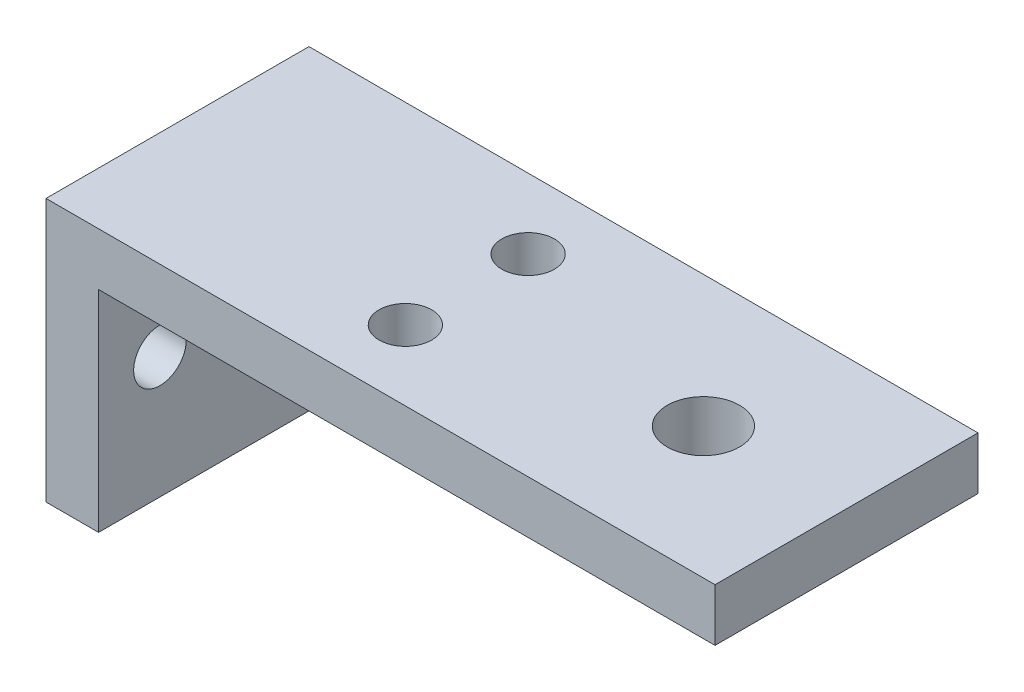
ISO-10303-21;
HEADER;
FILE_DESCRIPTION(('STEP AP214'),'2;1');
FILE_NAME('part.step','',(''),(''),'','','');
FILE_SCHEMA(('AUTOMOTIVE_DESIGN { 1 0 10303 214 1 1 1 1 }'));
ENDSEC;
DATA;
#1=APPLICATION_CONTEXT('core data for automotive mechanical design processes');
#2=APPLICATION_PROTOCOL_DEFINITION('international standard','automotive_design',2000,#1);
#3=PRODUCT_CONTEXT('',#1,'mechanical');
#4=PRODUCT('Part','Part','',(#3));
#5=PRODUCT_RELATED_PRODUCT_CATEGORY('part','',(#4));
#6=PRODUCT_DEFINITION_FORMATION('','',#4);
#7=PRODUCT_DEFINITION_CONTEXT('part definition',#1,'design');
#8=PRODUCT_DEFINITION('design','',#6,#7);
#9=PRODUCT_DEFINITION_SHAPE('','',#8);
#10=(LENGTH_UNIT() NAMED_UNIT(*) SI_UNIT(.MILLI.,.METRE.));
#11=(NAMED_UNIT(*) PLANE_ANGLE_UNIT() SI_UNIT($,.RADIAN.));
#12=(NAMED_UNIT(*) SI_UNIT($,.STERADIAN.) SOLID_ANGLE_UNIT());
#13=UNCERTAINTY_MEASURE_WITH_UNIT(LENGTH_MEASURE(1.E-05),#10,'distance_accuracy_value','');
#14=(GEOMETRIC_REPRESENTATION_CONTEXT(3) GLOBAL_UNCERTAINTY_ASSIGNED_CONTEXT((#13)) GLOBAL_UNIT_ASSIGNED_CONTEXT((#10,
#11,#12)) REPRESENTATION_CONTEXT('',''));
#15=CARTESIAN_POINT('',(0.,0.,0.));
#16=DIRECTION('',(0.,0.,1.));
#17=DIRECTION('',(1.,0.,0.));
#18=AXIS2_PLACEMENT_3D('',#15,#16,#17);
#19=CARTESIAN_POINT('',(1.5,0.,15.));
#20=DIRECTION('',(1.,0.,0.));
#21=DIRECTION('',(0.,1.,0.));
#22=AXIS2_PLACEMENT_3D('',#19,#20,#21);
#23=PLANE('',#22);
#24=CARTESIAN_POINT('',(1.5,-0.499999999999997,11.5));
#25=DIRECTION('',(1.,0.,0.));
#26=DIRECTION('',(0.,1.,0.));
#27=AXIS2_PLACEMENT_3D('',#24,#25,#26);
#28=CIRCLE('',#27,1.5);
#29=CARTESIAN_POINT('',(1.5,1.,11.5));
#30=VERTEX_POINT('',#29);
#31=EDGE_CURVE('E133',#30,#30,#28,.T.);
#32=ORIENTED_EDGE('',*,*,#31,.F.);
#33=EDGE_LOOP('',(#32));
#34=FACE_BOUND('',#33,.T.);
#35=CARTESIAN_POINT('',(1.5,-0.499999999999997,4.));
#36=DIRECTION('',(1.,0.,0.));
#37=DIRECTION('',(0.,1.,0.));
#38=AXIS2_PLACEMENT_3D('',#35,#36,#37);
#39=CIRCLE('',#38,1.5);
#40=CARTESIAN_POINT('',(1.5,1.,4.));
#41=VERTEX_POINT('',#40);
#42=EDGE_CURVE('E147',#41,#41,#39,.T.);
#43=ORIENTED_EDGE('',*,*,#42,.F.);
#44=EDGE_LOOP('',(#43));
#45=FACE_BOUND('',#44,.T.);
#46=DIRECTION('',(0.,-1.,0.));
#47=VECTOR('',#46,1.);
#48=CARTESIAN_POINT('',(1.5,0.,0.));
#49=LINE('',#48,#47);
#50=CARTESIAN_POINT('',(1.5,4.5,0.));
#51=VERTEX_POINT('',#50);
#52=CARTESIAN_POINT('',(1.5,-7.5,0.));
#53=VERTEX_POINT('',#52);
#54=EDGE_CURVE('E117',#51,#53,#49,.T.);
#55=ORIENTED_EDGE('',*,*,#54,.F.);
#56=DIRECTION('',(0.,0.,-1.));
#57=VECTOR('',#56,1.);
#58=CARTESIAN_POINT('',(1.5,4.5,15.));
#59=LINE('',#58,#57);
#60=CARTESIAN_POINT('',(1.5,4.5,15.));
#61=VERTEX_POINT('',#60);
#62=EDGE_CURVE('E42',#61,#51,#59,.T.);
#63=ORIENTED_EDGE('',*,*,#62,.F.);
#64=DIRECTION('',(0.,-1.,0.));
#65=VECTOR('',#64,1.);
#66=CARTESIAN_POINT('',(1.5,0.,15.));
#67=LINE('',#66,#65);
#68=CARTESIAN_POINT('',(1.5,-7.5,15.));
#69=VERTEX_POINT('',#68);
#70=EDGE_CURVE('E122',#61,#69,#67,.T.);
#71=ORIENTED_EDGE('',*,*,#70,.T.);
#72=DIRECTION('',(0.,0.,-1.));
#73=VECTOR('',#72,1.);
#74=CARTESIAN_POINT('',(1.5,-7.5,15.));
#75=LINE('',#74,#73);
#76=EDGE_CURVE('E78',#69,#53,#75,.T.);
#77=ORIENTED_EDGE('',*,*,#76,.T.);
#78=EDGE_LOOP('',(#55,#63,#71,#77));
#79=FACE_BOUND('',#78,.T.);
#80=ADVANCED_FACE('F35',(#34,#45,#79),#23,.T.);
#81=CARTESIAN_POINT('',(0.,4.5,15.));
#82=DIRECTION('',(0.,1.,0.));
#83=DIRECTION('',(0.,0.,1.));
#84=AXIS2_PLACEMENT_3D('',#81,#82,#83);
#85=PLANE('',#84);
#86=CARTESIAN_POINT('',(15.,4.5,4.));
#87=DIRECTION('',(0.,1.,0.));
#88=DIRECTION('',(0.,0.,1.));
#89=AXIS2_PLACEMENT_3D('',#86,#87,#88);
#90=CIRCLE('',#89,1.5);
#91=CARTESIAN_POINT('',(15.,4.5,5.5));
#92=VERTEX_POINT('',#91);
#93=EDGE_CURVE('E107',#92,#92,#90,.T.);
#94=ORIENTED_EDGE('',*,*,#93,.T.);
#95=EDGE_LOOP('',(#94));
#96=FACE_BOUND('',#95,.T.);
#97=CARTESIAN_POINT('',(15.,4.5,11.));
#98=DIRECTION('',(0.,1.,0.));
#99=DIRECTION('',(0.,0.,1.));
#100=AXIS2_PLACEMENT_3D('',#97,#98,#99);
#101=CIRCLE('',#100,1.5);
#102=CARTESIAN_POINT('',(15.,4.5,12.5));
#103=VERTEX_POINT('',#102);
#104=EDGE_CURVE('E162',#103,#103,#101,.T.);
#105=ORIENTED_EDGE('',*,*,#104,.T.);
#106=EDGE_LOOP('',(#105));
#107=FACE_BOUND('',#106,.T.);
#108=CARTESIAN_POINT('',(28.5,4.5,7.5));
#109=DIRECTION('',(0.,1.,0.));
#110=DIRECTION('',(0.,0.,1.));
#111=AXIS2_PLACEMENT_3D('',#108,#109,#110);
#112=CIRCLE('',#111,2.06366548108525);
#113=CARTESIAN_POINT('',(28.5,4.5,9.56366548108525));
#114=VERTEX_POINT('',#113);
#115=EDGE_CURVE('E150',#114,#114,#112,.T.);
#116=ORIENTED_EDGE('',*,*,#115,.T.);
#117=EDGE_LOOP('',(#116));
#118=FACE_BOUND('',#117,.T.);
#119=DIRECTION('',(1.,0.,0.));
#120=VECTOR('',#119,1.);
#121=CARTESIAN_POINT('',(0.,4.5,0.));
#122=LINE('',#121,#120);
#123=CARTESIAN_POINT('',(36.6642464156115,4.5,0.));
#124=VERTEX_POINT('',#123);
#125=EDGE_CURVE('E113',#51,#124,#122,.T.);
#126=ORIENTED_EDGE('',*,*,#125,.T.);
#127=DIRECTION('',(0.,0.,1.));
#128=VECTOR('',#127,1.);
#129=CARTESIAN_POINT('',(36.6642464156115,4.5,15.));
#130=LINE('',#129,#128);
#131=CARTESIAN_POINT('',(36.6642464156115,4.5,15.));
#132=VERTEX_POINT('',#131);
#133=EDGE_CURVE('E49',#124,#132,#130,.T.);
#134=ORIENTED_EDGE('',*,*,#133,.T.);
#135=DIRECTION('',(1.,0.,0.));
#136=VECTOR('',#135,1.);
#137=CARTESIAN_POINT('',(0.,4.5,15.));
#138=LINE('',#137,#136);
#139=EDGE_CURVE('E143',#61,#132,#138,.T.);
#140=ORIENTED_EDGE('',*,*,#139,.F.);
#141=ORIENTED_EDGE('',*,*,#62,.T.);
#142=EDGE_LOOP('',(#126,#134,#140,#141));
#143=FACE_BOUND('',#142,.T.);
#144=ADVANCED_FACE('F178',(#96,#107,#118,#143),#85,.F.);
#145=CARTESIAN_POINT('',(0.,7.5,15.));
#146=DIRECTION('',(0.,1.,0.));
#147=DIRECTION('',(0.,0.,1.));
#148=AXIS2_PLACEMENT_3D('',#145,#146,#147);
#149=PLANE('',#148);
#150=CARTESIAN_POINT('',(15.,7.5,4.));
#151=DIRECTION('',(0.,1.,0.));
#152=DIRECTION('',(0.,0.,1.));
#153=AXIS2_PLACEMENT_3D('',#150,#151,#152);
#154=CIRCLE('',#153,1.5);
#155=CARTESIAN_POINT('',(15.,7.5,5.5));
#156=VERTEX_POINT('',#155);
#157=EDGE_CURVE('E165',#156,#156,#154,.T.);
#158=ORIENTED_EDGE('',*,*,#157,.F.);
#159=EDGE_LOOP('',(#158));
#160=FACE_BOUND('',#159,.T.);
#161=CARTESIAN_POINT('',(15.,7.5,11.));
#162=DIRECTION('',(0.,1.,0.));
#163=DIRECTION('',(0.,0.,1.));
#164=AXIS2_PLACEMENT_3D('',#161,#162,#163);
#165=CIRCLE('',#164,1.5);
#166=CARTESIAN_POINT('',(15.,7.5,12.5));
#167=VERTEX_POINT('',#166);
#168=EDGE_CURVE('E166',#167,#167,#165,.T.);
#169=ORIENTED_EDGE('',*,*,#168,.F.);
#170=EDGE_LOOP('',(#169));
#171=FACE_BOUND('',#170,.T.);
#172=DIRECTION('',(0.,0.,1.));
#173=VECTOR('',#172,1.);
#174=CARTESIAN_POINT('',(36.6642464156115,7.5,15.));
#175=LINE('',#174,#173);
#176=CARTESIAN_POINT('',(36.6642464156115,7.5,0.));
#177=VERTEX_POINT('',#176);
#178=CARTESIAN_POINT('',(36.6642464156115,7.5,15.));
#179=VERTEX_POINT('',#178);
#180=EDGE_CURVE('E92',#177,#179,#175,.T.);
#181=ORIENTED_EDGE('',*,*,#180,.F.);
#182=DIRECTION('',(1.,0.,0.));
#183=VECTOR('',#182,1.);
#184=CARTESIAN_POINT('',(0.,7.5,0.));
#185=LINE('',#184,#183);
#186=CARTESIAN_POINT('',(-1.5,7.5,0.));
#187=VERTEX_POINT('',#186);
#188=EDGE_CURVE('E103',#187,#177,#185,.T.);
#189=ORIENTED_EDGE('',*,*,#188,.F.);
#190=DIRECTION('',(0.,0.,-1.));
#191=VECTOR('',#190,1.);
#192=CARTESIAN_POINT('',(-1.5,7.5,15.));
#193=LINE('',#192,#191);
#194=CARTESIAN_POINT('',(-1.5,7.5,15.));
#195=VERTEX_POINT('',#194);
#196=EDGE_CURVE('E127',#195,#187,#193,.T.);
#197=ORIENTED_EDGE('',*,*,#196,.F.);
#198=DIRECTION('',(1.,0.,0.));
#199=VECTOR('',#198,1.);
#200=CARTESIAN_POINT('',(0.,7.5,15.));
#201=LINE('',#200,#199);
#202=EDGE_CURVE('E105',#195,#179,#201,.T.);
#203=ORIENTED_EDGE('',*,*,#202,.T.);
#204=EDGE_LOOP('',(#181,#189,#197,#203));
#205=FACE_BOUND('',#204,.T.);
#206=CARTESIAN_POINT('',(28.5,7.5,7.5));
#207=DIRECTION('',(0.,1.,0.));
#208=DIRECTION('',(0.,0.,1.));
#209=AXIS2_PLACEMENT_3D('',#206,#207,#208);
#210=CIRCLE('',#209,2.06366548108525);
#211=CARTESIAN_POINT('',(28.5,7.5,9.56366548108525));
#212=VERTEX_POINT('',#211);
#213=EDGE_CURVE('E155',#212,#212,#210,.T.);
#214=ORIENTED_EDGE('',*,*,#213,.F.);
#215=EDGE_LOOP('',(#214));
#216=FACE_BOUND('',#215,.T.);
#217=ADVANCED_FACE('F101',(#160,#171,#205,#216),#149,.T.);
#218=CARTESIAN_POINT('',(-1.5,0.,15.));
#219=DIRECTION('',(1.,0.,0.));
#220=DIRECTION('',(0.,1.,0.));
#221=AXIS2_PLACEMENT_3D('',#218,#219,#220);
#222=PLANE('',#221);
#223=CARTESIAN_POINT('',(-1.5,-0.499999999999997,11.5));
#224=DIRECTION('',(1.,0.,0.));
#225=DIRECTION('',(0.,1.,0.));
#226=AXIS2_PLACEMENT_3D('',#223,#224,#225);
#227=CIRCLE('',#226,1.5);
#228=CARTESIAN_POINT('',(-1.5,1.,11.5));
#229=VERTEX_POINT('',#228);
#230=EDGE_CURVE('E132',#229,#229,#227,.T.);
#231=ORIENTED_EDGE('',*,*,#230,.T.);
#232=EDGE_LOOP('',(#231));
#233=FACE_BOUND('',#232,.T.);
#234=CARTESIAN_POINT('',(-1.5,-0.499999999999997,4.));
#235=DIRECTION('',(1.,0.,0.));
#236=DIRECTION('',(0.,1.,0.));
#237=AXIS2_PLACEMENT_3D('',#234,#235,#236);
#238=CIRCLE('',#237,1.5);
#239=CARTESIAN_POINT('',(-1.5,1.,4.));
#240=VERTEX_POINT('',#239);
#241=EDGE_CURVE('E130',#240,#240,#238,.T.);
#242=ORIENTED_EDGE('',*,*,#241,.T.);
#243=EDGE_LOOP('',(#242));
#244=FACE_BOUND('',#243,.T.);
#245=DIRECTION('',(0.,-1.,0.));
#246=VECTOR('',#245,1.);
#247=CARTESIAN_POINT('',(-1.5,0.,0.));
#248=LINE('',#247,#246);
#249=CARTESIAN_POINT('',(-1.5,-7.5,0.));
#250=VERTEX_POINT('',#249);
#251=EDGE_CURVE('E112',#187,#250,#248,.T.);
#252=ORIENTED_EDGE('',*,*,#251,.T.);
#253=DIRECTION('',(0.,0.,-1.));
#254=VECTOR('',#253,1.);
#255=CARTESIAN_POINT('',(-1.5,-7.5,15.));
#256=LINE('',#255,#254);
#257=CARTESIAN_POINT('',(-1.5,-7.5,15.));
#258=VERTEX_POINT('',#257);
#259=EDGE_CURVE('E124',#258,#250,#256,.T.);
#260=ORIENTED_EDGE('',*,*,#259,.F.);
#261=DIRECTION('',(0.,-1.,0.));
#262=VECTOR('',#261,1.);
#263=CARTESIAN_POINT('',(-1.5,0.,15.));
#264=LINE('',#263,#262);
#265=EDGE_CURVE('E140',#195,#258,#264,.T.);
#266=ORIENTED_EDGE('',*,*,#265,.F.);
#267=ORIENTED_EDGE('',*,*,#196,.T.);
#268=EDGE_LOOP('',(#252,#260,#266,#267));
#269=FACE_BOUND('',#268,.T.);
#270=ADVANCED_FACE('F177',(#233,#244,#269),#222,.F.);
#271=CARTESIAN_POINT('',(0.,-7.5,15.));
#272=DIRECTION('',(0.,1.,0.));
#273=DIRECTION('',(0.,0.,1.));
#274=AXIS2_PLACEMENT_3D('',#271,#272,#273);
#275=PLANE('',#274);
#276=DIRECTION('',(1.,0.,0.));
#277=VECTOR('',#276,1.);
#278=CARTESIAN_POINT('',(0.,-7.5,0.));
#279=LINE('',#278,#277);
#280=EDGE_CURVE('E115',#250,#53,#279,.T.);
#281=ORIENTED_EDGE('',*,*,#280,.T.);
#282=ORIENTED_EDGE('',*,*,#76,.F.);
#283=DIRECTION('',(1.,0.,0.));
#284=VECTOR('',#283,1.);
#285=CARTESIAN_POINT('',(0.,-7.5,15.));
#286=LINE('',#285,#284);
#287=EDGE_CURVE('E57',#258,#69,#286,.T.);
#288=ORIENTED_EDGE('',*,*,#287,.F.);
#289=ORIENTED_EDGE('',*,*,#259,.T.);
#290=EDGE_LOOP('',(#281,#282,#288,#289));
#291=FACE_BOUND('',#290,.T.);
#292=ADVANCED_FACE('F211',(#291),#275,.F.);
#293=CARTESIAN_POINT('',(0.,0.,15.));
#294=DIRECTION('',(0.,0.,1.));
#295=DIRECTION('',(1.,0.,0.));
#296=AXIS2_PLACEMENT_3D('',#293,#294,#295);
#297=PLANE('',#296);
#298=DIRECTION('',(0.,1.,0.));
#299=VECTOR('',#298,1.);
#300=CARTESIAN_POINT('',(36.6642464156115,-22.5,15.));
#301=LINE('',#300,#299);
#302=EDGE_CURVE('E106',#132,#179,#301,.T.);
#303=ORIENTED_EDGE('',*,*,#302,.T.);
#304=ORIENTED_EDGE('',*,*,#202,.F.);
#305=ORIENTED_EDGE('',*,*,#265,.T.);
#306=ORIENTED_EDGE('',*,*,#287,.T.);
#307=ORIENTED_EDGE('',*,*,#70,.F.);
#308=ORIENTED_EDGE('',*,*,#139,.T.);
#309=EDGE_LOOP('',(#303,#304,#305,#306,#307,#308));
#310=FACE_BOUND('',#309,.T.);
#311=ADVANCED_FACE('F216',(#310),#297,.T.);
#312=CARTESIAN_POINT('',(0.,0.,0.));
#313=DIRECTION('',(0.,0.,1.));
#314=DIRECTION('',(1.,0.,0.));
#315=AXIS2_PLACEMENT_3D('',#312,#313,#314);
#316=PLANE('',#315);
#317=ORIENTED_EDGE('',*,*,#188,.T.);
#318=DIRECTION('',(0.,-1.,0.));
#319=VECTOR('',#318,1.);
#320=CARTESIAN_POINT('',(36.6642464156115,0.,0.));
#321=LINE('',#320,#319);
#322=EDGE_CURVE('E11',#177,#124,#321,.T.);
#323=ORIENTED_EDGE('',*,*,#322,.T.);
#324=ORIENTED_EDGE('',*,*,#125,.F.);
#325=ORIENTED_EDGE('',*,*,#54,.T.);
#326=ORIENTED_EDGE('',*,*,#280,.F.);
#327=ORIENTED_EDGE('',*,*,#251,.F.);
#328=EDGE_LOOP('',(#317,#323,#324,#325,#326,#327));
#329=FACE_BOUND('',#328,.T.);
#330=ADVANCED_FACE('F110',(#329),#316,.F.);
#331=CARTESIAN_POINT('',(-28.5,-0.5,4.));
#332=DIRECTION('',(1.,0.,0.));
#333=DIRECTION('',(0.,1.,0.));
#334=AXIS2_PLACEMENT_3D('',#331,#332,#333);
#335=CYLINDRICAL_SURFACE('',#334,1.5);
#336=ORIENTED_EDGE('',*,*,#42,.T.);
#337=EDGE_LOOP('',(#336));
#338=FACE_BOUND('',#337,.T.);
#339=ORIENTED_EDGE('',*,*,#241,.F.);
#340=EDGE_LOOP('',(#339));
#341=FACE_BOUND('',#340,.T.);
#342=ADVANCED_FACE('F202',(#338,#341),#335,.F.);
#343=CARTESIAN_POINT('',(-28.5,-0.5,11.5));
#344=DIRECTION('',(1.,0.,0.));
#345=DIRECTION('',(0.,1.,0.));
#346=AXIS2_PLACEMENT_3D('',#343,#344,#345);
#347=CYLINDRICAL_SURFACE('',#346,1.5);
#348=ORIENTED_EDGE('',*,*,#31,.T.);
#349=EDGE_LOOP('',(#348));
#350=FACE_BOUND('',#349,.T.);
#351=ORIENTED_EDGE('',*,*,#230,.F.);
#352=EDGE_LOOP('',(#351));
#353=FACE_BOUND('',#352,.T.);
#354=ADVANCED_FACE('F205',(#350,#353),#347,.F.);
#355=CARTESIAN_POINT('',(28.5,-2.5,7.5));
#356=DIRECTION('',(0.,1.,0.));
#357=DIRECTION('',(0.,0.,1.));
#358=AXIS2_PLACEMENT_3D('',#355,#356,#357);
#359=CYLINDRICAL_SURFACE('',#358,2.06366548108525);
#360=ORIENTED_EDGE('',*,*,#213,.T.);
#361=EDGE_LOOP('',(#360));
#362=FACE_BOUND('',#361,.T.);
#363=ORIENTED_EDGE('',*,*,#115,.F.);
#364=EDGE_LOOP('',(#363));
#365=FACE_BOUND('',#364,.T.);
#366=ADVANCED_FACE('F228',(#362,#365),#359,.F.);
#367=CARTESIAN_POINT('',(36.6642464156115,-22.5,15.));
#368=DIRECTION('',(-1.,0.,0.));
#369=DIRECTION('',(0.,0.,1.));
#370=AXIS2_PLACEMENT_3D('',#367,#368,#369);
#371=PLANE('',#370);
#372=ORIENTED_EDGE('',*,*,#322,.F.);
#373=ORIENTED_EDGE('',*,*,#180,.T.);
#374=ORIENTED_EDGE('',*,*,#302,.F.);
#375=ORIENTED_EDGE('',*,*,#133,.F.);
#376=EDGE_LOOP('',(#372,#373,#374,#375));
#377=FACE_BOUND('',#376,.T.);
#378=ADVANCED_FACE('F91',(#377),#371,.F.);
#379=CARTESIAN_POINT('',(15.,-2.5,11.));
#380=DIRECTION('',(0.,1.,0.));
#381=DIRECTION('',(0.,0.,1.));
#382=AXIS2_PLACEMENT_3D('',#379,#380,#381);
#383=CYLINDRICAL_SURFACE('',#382,1.5);
#384=ORIENTED_EDGE('',*,*,#168,.T.);
#385=EDGE_LOOP('',(#384));
#386=FACE_BOUND('',#385,.T.);
#387=ORIENTED_EDGE('',*,*,#104,.F.);
#388=EDGE_LOOP('',(#387));
#389=FACE_BOUND('',#388,.T.);
#390=ADVANCED_FACE('F182',(#386,#389),#383,.F.);
#391=CARTESIAN_POINT('',(15.,-2.5,4.));
#392=DIRECTION('',(0.,1.,0.));
#393=DIRECTION('',(0.,0.,1.));
#394=AXIS2_PLACEMENT_3D('',#391,#392,#393);
#395=CYLINDRICAL_SURFACE('',#394,1.5);
#396=ORIENTED_EDGE('',*,*,#157,.T.);
#397=EDGE_LOOP('',(#396));
#398=FACE_BOUND('',#397,.T.);
#399=ORIENTED_EDGE('',*,*,#93,.F.);
#400=EDGE_LOOP('',(#399));
#401=FACE_BOUND('',#400,.T.);
#402=ADVANCED_FACE('F172',(#398,#401),#395,.F.);
#403=CLOSED_SHELL('',(#80,#144,#217,#270,#292,#311,#330,#342,#354,#366,#378,#390,#402));
#404=MANIFOLD_SOLID_BREP('B2',#403);
#405=ADVANCED_BREP_SHAPE_REPRESENTATION('',(#18,#404),#14);
#406=SHAPE_DEFINITION_REPRESENTATION(#9,#405);
ENDSEC;
END-ISO-10303-21;
